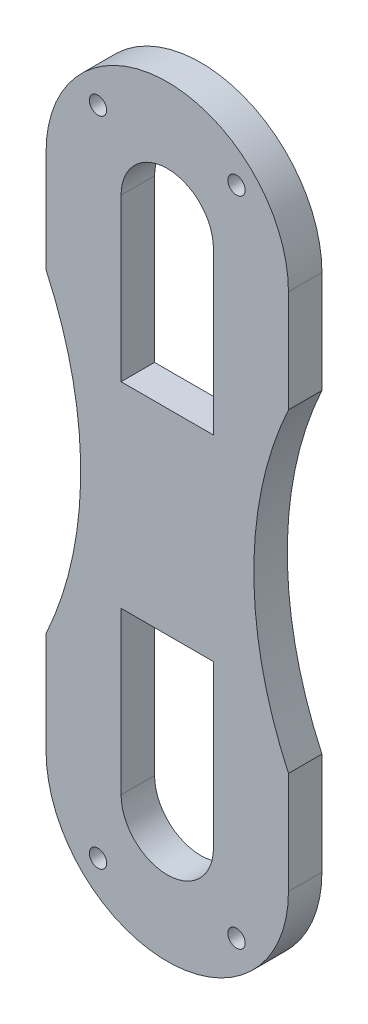
ISO-10303-21;
HEADER;
FILE_DESCRIPTION(('STEP AP214'),'2;1');
FILE_NAME('part.step','',(''),(''),'','','');
FILE_SCHEMA(('AUTOMOTIVE_DESIGN { 1 0 10303 214 1 1 1 1 }'));
ENDSEC;
DATA;
#1=APPLICATION_CONTEXT('core data for automotive mechanical design processes');
#2=APPLICATION_PROTOCOL_DEFINITION('international standard','automotive_design',2000,#1);
#3=PRODUCT_CONTEXT('',#1,'mechanical');
#4=PRODUCT('Part','Part','',(#3));
#5=PRODUCT_RELATED_PRODUCT_CATEGORY('part','',(#4));
#6=PRODUCT_DEFINITION_FORMATION('','',#4);
#7=PRODUCT_DEFINITION_CONTEXT('part definition',#1,'design');
#8=PRODUCT_DEFINITION('design','',#6,#7);
#9=PRODUCT_DEFINITION_SHAPE('','',#8);
#10=(LENGTH_UNIT() NAMED_UNIT(*) SI_UNIT(.MILLI.,.METRE.));
#11=(NAMED_UNIT(*) PLANE_ANGLE_UNIT() SI_UNIT($,.RADIAN.));
#12=(NAMED_UNIT(*) SI_UNIT($,.STERADIAN.) SOLID_ANGLE_UNIT());
#13=UNCERTAINTY_MEASURE_WITH_UNIT(LENGTH_MEASURE(1.E-05),#10,'distance_accuracy_value','');
#14=(GEOMETRIC_REPRESENTATION_CONTEXT(3) GLOBAL_UNCERTAINTY_ASSIGNED_CONTEXT((#13)) GLOBAL_UNIT_ASSIGNED_CONTEXT((#10,
#11,#12)) REPRESENTATION_CONTEXT('',''));
#15=CARTESIAN_POINT('',(0.,0.,0.));
#16=DIRECTION('',(0.,0.,1.));
#17=DIRECTION('',(1.,0.,0.));
#18=AXIS2_PLACEMENT_3D('',#15,#16,#17);
#19=CARTESIAN_POINT('',(4.,0.,2.9));
#20=DIRECTION('',(-1.,0.,0.));
#21=DIRECTION('',(0.,-1.,0.));
#22=AXIS2_PLACEMENT_3D('',#19,#20,#21);
#23=PLANE('',#22);
#24=DIRECTION('',(0.,1.,0.));
#25=VECTOR('',#24,1.);
#26=CARTESIAN_POINT('',(4.,0.,0.));
#27=LINE('',#26,#25);
#28=CARTESIAN_POINT('',(3.99999999999999,-22.5000003712386,0.));
#29=VERTEX_POINT('',#28);
#30=CARTESIAN_POINT('',(4.,-8.50000000000002,0.));
#31=VERTEX_POINT('',#30);
#32=EDGE_CURVE('E260',#29,#31,#27,.T.);
#33=ORIENTED_EDGE('',*,*,#32,.F.);
#34=DIRECTION('',(0.,0.,-1.));
#35=VECTOR('',#34,1.);
#36=CARTESIAN_POINT('',(3.99999999999999,-22.5000003712386,2.9));
#37=LINE('',#36,#35);
#38=CARTESIAN_POINT('',(3.99999999999999,-22.5000003712386,2.9));
#39=VERTEX_POINT('',#38);
#40=EDGE_CURVE('E11',#39,#29,#37,.T.);
#41=ORIENTED_EDGE('',*,*,#40,.F.);
#42=DIRECTION('',(0.,1.,0.));
#43=VECTOR('',#42,1.);
#44=CARTESIAN_POINT('',(4.,0.,2.9));
#45=LINE('',#44,#43);
#46=CARTESIAN_POINT('',(4.,-8.50000000000002,2.9));
#47=VERTEX_POINT('',#46);
#48=EDGE_CURVE('E172',#39,#47,#45,.T.);
#49=ORIENTED_EDGE('',*,*,#48,.T.);
#50=DIRECTION('',(0.,0.,-1.));
#51=VECTOR('',#50,1.);
#52=CARTESIAN_POINT('',(4.,-8.50000000000002,2.9));
#53=LINE('',#52,#51);
#54=EDGE_CURVE('E113',#47,#31,#53,.T.);
#55=ORIENTED_EDGE('',*,*,#54,.T.);
#56=EDGE_LOOP('',(#33,#41,#49,#55));
#57=FACE_BOUND('',#56,.T.);
#58=ADVANCED_FACE('F36',(#57),#23,.T.);
#59=CARTESIAN_POINT('',(0.,-22.5,2.9));
#60=DIRECTION('',(0.,0.,-1.));
#61=DIRECTION('',(-1.,0.,0.));
#62=AXIS2_PLACEMENT_3D('',#59,#60,#61);
#63=CYLINDRICAL_SURFACE('',#62,4.00000000000002);
#64=CARTESIAN_POINT('',(0.,-22.5,0.));
#65=DIRECTION('',(0.,0.,1.));
#66=DIRECTION('',(1.,0.,0.));
#67=AXIS2_PLACEMENT_3D('',#64,#65,#66);
#68=CIRCLE('',#67,4.00000000000002);
#69=CARTESIAN_POINT('',(-4.00000000000001,-22.4999996286907,0.));
#70=VERTEX_POINT('',#69);
#71=EDGE_CURVE('E177',#29,#70,#68,.F.);
#72=ORIENTED_EDGE('',*,*,#71,.T.);
#73=DIRECTION('',(0.,0.,-1.));
#74=VECTOR('',#73,1.);
#75=CARTESIAN_POINT('',(-4.00000000000001,-22.4999996286907,2.9));
#76=LINE('',#75,#74);
#77=CARTESIAN_POINT('',(-4.00000000000001,-22.4999996286907,2.9));
#78=VERTEX_POINT('',#77);
#79=EDGE_CURVE('E46',#78,#70,#76,.T.);
#80=ORIENTED_EDGE('',*,*,#79,.F.);
#81=CARTESIAN_POINT('',(0.,-22.5,2.9));
#82=DIRECTION('',(0.,0.,1.));
#83=DIRECTION('',(1.,0.,0.));
#84=AXIS2_PLACEMENT_3D('',#81,#82,#83);
#85=CIRCLE('',#84,4.00000000000002);
#86=EDGE_CURVE('E167',#39,#78,#85,.F.);
#87=ORIENTED_EDGE('',*,*,#86,.F.);
#88=ORIENTED_EDGE('',*,*,#40,.T.);
#89=EDGE_LOOP('',(#72,#80,#87,#88));
#90=FACE_BOUND('',#89,.T.);
#91=ADVANCED_FACE('F175',(#90),#63,.F.);
#92=CARTESIAN_POINT('',(-4.00000000000001,0.,2.9));
#93=DIRECTION('',(-1.,0.,0.));
#94=DIRECTION('',(0.,-1.,0.));
#95=AXIS2_PLACEMENT_3D('',#92,#93,#94);
#96=PLANE('',#95);
#97=DIRECTION('',(0.,1.,0.));
#98=VECTOR('',#97,1.);
#99=CARTESIAN_POINT('',(-4.00000000000001,0.,0.));
#100=LINE('',#99,#98);
#101=CARTESIAN_POINT('',(-4.00000000000001,-8.50000000000002,0.));
#102=VERTEX_POINT('',#101);
#103=EDGE_CURVE('E263',#70,#102,#100,.T.);
#104=ORIENTED_EDGE('',*,*,#103,.T.);
#105=DIRECTION('',(0.,0.,-1.));
#106=VECTOR('',#105,1.);
#107=CARTESIAN_POINT('',(-4.00000000000001,-8.50000000000002,2.9));
#108=LINE('',#107,#106);
#109=CARTESIAN_POINT('',(-4.00000000000001,-8.50000000000002,2.9));
#110=VERTEX_POINT('',#109);
#111=EDGE_CURVE('E166',#110,#102,#108,.T.);
#112=ORIENTED_EDGE('',*,*,#111,.F.);
#113=DIRECTION('',(0.,1.,0.));
#114=VECTOR('',#113,1.);
#115=CARTESIAN_POINT('',(-4.00000000000001,0.,2.9));
#116=LINE('',#115,#114);
#117=EDGE_CURVE('E160',#78,#110,#116,.T.);
#118=ORIENTED_EDGE('',*,*,#117,.F.);
#119=ORIENTED_EDGE('',*,*,#79,.T.);
#120=EDGE_LOOP('',(#104,#112,#118,#119));
#121=FACE_BOUND('',#120,.T.);
#122=ADVANCED_FACE('F163',(#121),#96,.F.);
#123=CARTESIAN_POINT('',(-10.5,0.,2.9));
#124=DIRECTION('',(1.,0.,0.));
#125=DIRECTION('',(0.,1.,0.));
#126=AXIS2_PLACEMENT_3D('',#123,#124,#125);
#127=PLANE('',#126);
#128=DIRECTION('',(0.,-1.,0.));
#129=VECTOR('',#128,1.);
#130=CARTESIAN_POINT('',(-10.5,0.,0.));
#131=LINE('',#130,#129);
#132=CARTESIAN_POINT('',(-10.5,22.5,0.));
#133=VERTEX_POINT('',#132);
#134=CARTESIAN_POINT('',(-10.5,13.6381816969859,0.));
#135=VERTEX_POINT('',#134);
#136=EDGE_CURVE('E238',#133,#135,#131,.T.);
#137=ORIENTED_EDGE('',*,*,#136,.T.);
#138=DIRECTION('',(0.,0.,-1.));
#139=VECTOR('',#138,1.);
#140=CARTESIAN_POINT('',(-10.5,13.6381816969859,2.9));
#141=LINE('',#140,#139);
#142=CARTESIAN_POINT('',(-10.5,13.6381816969859,2.9));
#143=VERTEX_POINT('',#142);
#144=EDGE_CURVE('E198',#143,#135,#141,.T.);
#145=ORIENTED_EDGE('',*,*,#144,.F.);
#146=DIRECTION('',(0.,-1.,0.));
#147=VECTOR('',#146,1.);
#148=CARTESIAN_POINT('',(-10.5,0.,2.9));
#149=LINE('',#148,#147);
#150=CARTESIAN_POINT('',(-10.5,22.5,2.9));
#151=VERTEX_POINT('',#150);
#152=EDGE_CURVE('E290',#151,#143,#149,.T.);
#153=ORIENTED_EDGE('',*,*,#152,.F.);
#154=DIRECTION('',(0.,0.,-1.));
#155=VECTOR('',#154,1.);
#156=CARTESIAN_POINT('',(-10.5,22.5,2.9));
#157=LINE('',#156,#155);
#158=EDGE_CURVE('E182',#151,#133,#157,.T.);
#159=ORIENTED_EDGE('',*,*,#158,.T.);
#160=EDGE_LOOP('',(#137,#145,#153,#159));
#161=FACE_BOUND('',#160,.T.);
#162=ADVANCED_FACE('F375',(#161),#127,.F.);
#163=CARTESIAN_POINT('',(-40.,0.,2.9));
#164=DIRECTION('',(0.,0.,-1.));
#165=DIRECTION('',(-1.,0.,0.));
#166=AXIS2_PLACEMENT_3D('',#163,#164,#165);
#167=CYLINDRICAL_SURFACE('',#166,32.5);
#168=CARTESIAN_POINT('',(-40.,0.,0.));
#169=DIRECTION('',(0.,0.,1.));
#170=DIRECTION('',(1.,0.,0.));
#171=AXIS2_PLACEMENT_3D('',#168,#169,#170);
#172=CIRCLE('',#171,32.5);
#173=CARTESIAN_POINT('',(-10.5,-13.6381816969859,0.));
#174=VERTEX_POINT('',#173);
#175=EDGE_CURVE('E241',#135,#174,#172,.F.);
#176=ORIENTED_EDGE('',*,*,#175,.T.);
#177=DIRECTION('',(0.,0.,-1.));
#178=VECTOR('',#177,1.);
#179=CARTESIAN_POINT('',(-10.5,-13.6381816969859,2.9));
#180=LINE('',#179,#178);
#181=CARTESIAN_POINT('',(-10.5,-13.6381816969859,2.9));
#182=VERTEX_POINT('',#181);
#183=EDGE_CURVE('E195',#182,#174,#180,.T.);
#184=ORIENTED_EDGE('',*,*,#183,.F.);
#185=CARTESIAN_POINT('',(-40.,0.,2.9));
#186=DIRECTION('',(0.,0.,1.));
#187=DIRECTION('',(1.,0.,0.));
#188=AXIS2_PLACEMENT_3D('',#185,#186,#187);
#189=CIRCLE('',#188,32.5);
#190=EDGE_CURVE('E293',#143,#182,#189,.F.);
#191=ORIENTED_EDGE('',*,*,#190,.F.);
#192=ORIENTED_EDGE('',*,*,#144,.T.);
#193=EDGE_LOOP('',(#176,#184,#191,#192));
#194=FACE_BOUND('',#193,.T.);
#195=ADVANCED_FACE('F371',(#194),#167,.F.);
#196=CARTESIAN_POINT('',(-10.5,0.,2.9));
#197=DIRECTION('',(1.,0.,0.));
#198=DIRECTION('',(0.,1.,0.));
#199=AXIS2_PLACEMENT_3D('',#196,#197,#198);
#200=PLANE('',#199);
#201=DIRECTION('',(0.,-1.,0.));
#202=VECTOR('',#201,1.);
#203=CARTESIAN_POINT('',(-10.5,0.,0.));
#204=LINE('',#203,#202);
#205=CARTESIAN_POINT('',(-10.5,-22.5,0.));
#206=VERTEX_POINT('',#205);
#207=EDGE_CURVE('E243',#174,#206,#204,.T.);
#208=ORIENTED_EDGE('',*,*,#207,.T.);
#209=DIRECTION('',(0.,0.,-1.));
#210=VECTOR('',#209,1.);
#211=CARTESIAN_POINT('',(-10.5,-22.5,2.9));
#212=LINE('',#211,#210);
#213=CARTESIAN_POINT('',(-10.5,-22.5,2.9));
#214=VERTEX_POINT('',#213);
#215=EDGE_CURVE('E193',#214,#206,#212,.T.);
#216=ORIENTED_EDGE('',*,*,#215,.F.);
#217=DIRECTION('',(0.,-1.,0.));
#218=VECTOR('',#217,1.);
#219=CARTESIAN_POINT('',(-10.5,0.,2.9));
#220=LINE('',#219,#218);
#221=EDGE_CURVE('E295',#182,#214,#220,.T.);
#222=ORIENTED_EDGE('',*,*,#221,.F.);
#223=ORIENTED_EDGE('',*,*,#183,.T.);
#224=EDGE_LOOP('',(#208,#216,#222,#223));
#225=FACE_BOUND('',#224,.T.);
#226=ADVANCED_FACE('F367',(#225),#200,.F.);
#227=CARTESIAN_POINT('',(0.,-22.5,2.9));
#228=DIRECTION('',(0.,0.,-1.));
#229=DIRECTION('',(-1.,0.,0.));
#230=AXIS2_PLACEMENT_3D('',#227,#228,#229);
#231=CYLINDRICAL_SURFACE('',#230,10.5);
#232=CARTESIAN_POINT('',(0.,-22.5,0.));
#233=DIRECTION('',(0.,0.,1.));
#234=DIRECTION('',(1.,0.,0.));
#235=AXIS2_PLACEMENT_3D('',#232,#233,#234);
#236=CIRCLE('',#235,10.5);
#237=CARTESIAN_POINT('',(10.5,-22.5,0.));
#238=VERTEX_POINT('',#237);
#239=EDGE_CURVE('E246',#238,#206,#236,.F.);
#240=ORIENTED_EDGE('',*,*,#239,.F.);
#241=DIRECTION('',(0.,0.,-1.));
#242=VECTOR('',#241,1.);
#243=CARTESIAN_POINT('',(10.5,-22.5,2.9));
#244=LINE('',#243,#242);
#245=CARTESIAN_POINT('',(10.5,-22.5,2.9));
#246=VERTEX_POINT('',#245);
#247=EDGE_CURVE('E191',#246,#238,#244,.T.);
#248=ORIENTED_EDGE('',*,*,#247,.F.);
#249=CARTESIAN_POINT('',(0.,-22.5,2.9));
#250=DIRECTION('',(0.,0.,1.));
#251=DIRECTION('',(1.,0.,0.));
#252=AXIS2_PLACEMENT_3D('',#249,#250,#251);
#253=CIRCLE('',#252,10.5);
#254=EDGE_CURVE('E297',#246,#214,#253,.F.);
#255=ORIENTED_EDGE('',*,*,#254,.T.);
#256=ORIENTED_EDGE('',*,*,#215,.T.);
#257=EDGE_LOOP('',(#240,#248,#255,#256));
#258=FACE_BOUND('',#257,.T.);
#259=ADVANCED_FACE('F363',(#258),#231,.T.);
#260=CARTESIAN_POINT('',(10.5,0.,2.9));
#261=DIRECTION('',(1.,0.,0.));
#262=DIRECTION('',(0.,1.,0.));
#263=AXIS2_PLACEMENT_3D('',#260,#261,#262);
#264=PLANE('',#263);
#265=DIRECTION('',(0.,-1.,0.));
#266=VECTOR('',#265,1.);
#267=CARTESIAN_POINT('',(10.5,0.,0.));
#268=LINE('',#267,#266);
#269=CARTESIAN_POINT('',(10.5,-13.6381816969859,0.));
#270=VERTEX_POINT('',#269);
#271=EDGE_CURVE('E249',#270,#238,#268,.T.);
#272=ORIENTED_EDGE('',*,*,#271,.F.);
#273=DIRECTION('',(0.,0.,-1.));
#274=VECTOR('',#273,1.);
#275=CARTESIAN_POINT('',(10.5,-13.6381816969859,2.9));
#276=LINE('',#275,#274);
#277=CARTESIAN_POINT('',(10.5,-13.6381816969859,2.9));
#278=VERTEX_POINT('',#277);
#279=EDGE_CURVE('E189',#278,#270,#276,.T.);
#280=ORIENTED_EDGE('',*,*,#279,.F.);
#281=DIRECTION('',(0.,-1.,0.));
#282=VECTOR('',#281,1.);
#283=CARTESIAN_POINT('',(10.5,0.,2.9));
#284=LINE('',#283,#282);
#285=EDGE_CURVE('E300',#278,#246,#284,.T.);
#286=ORIENTED_EDGE('',*,*,#285,.T.);
#287=ORIENTED_EDGE('',*,*,#247,.T.);
#288=EDGE_LOOP('',(#272,#280,#286,#287));
#289=FACE_BOUND('',#288,.T.);
#290=ADVANCED_FACE('F359',(#289),#264,.T.);
#291=CARTESIAN_POINT('',(40.,0.,2.9));
#292=DIRECTION('',(0.,0.,-1.));
#293=DIRECTION('',(-1.,0.,0.));
#294=AXIS2_PLACEMENT_3D('',#291,#292,#293);
#295=CYLINDRICAL_SURFACE('',#294,32.5);
#296=CARTESIAN_POINT('',(40.,0.,0.));
#297=DIRECTION('',(0.,0.,1.));
#298=DIRECTION('',(1.,0.,0.));
#299=AXIS2_PLACEMENT_3D('',#296,#297,#298);
#300=CIRCLE('',#299,32.5);
#301=CARTESIAN_POINT('',(10.5,13.6381816969859,0.));
#302=VERTEX_POINT('',#301);
#303=EDGE_CURVE('E252',#302,#270,#300,.T.);
#304=ORIENTED_EDGE('',*,*,#303,.F.);
#305=DIRECTION('',(0.,0.,-1.));
#306=VECTOR('',#305,1.);
#307=CARTESIAN_POINT('',(10.5,13.6381816969859,2.9));
#308=LINE('',#307,#306);
#309=CARTESIAN_POINT('',(10.5,13.6381816969859,2.9));
#310=VERTEX_POINT('',#309);
#311=EDGE_CURVE('E187',#310,#302,#308,.T.);
#312=ORIENTED_EDGE('',*,*,#311,.F.);
#313=CARTESIAN_POINT('',(40.,0.,2.9));
#314=DIRECTION('',(0.,0.,1.));
#315=DIRECTION('',(1.,0.,0.));
#316=AXIS2_PLACEMENT_3D('',#313,#314,#315);
#317=CIRCLE('',#316,32.5);
#318=EDGE_CURVE('E303',#310,#278,#317,.T.);
#319=ORIENTED_EDGE('',*,*,#318,.T.);
#320=ORIENTED_EDGE('',*,*,#279,.T.);
#321=EDGE_LOOP('',(#304,#312,#319,#320));
#322=FACE_BOUND('',#321,.T.);
#323=ADVANCED_FACE('F355',(#322),#295,.F.);
#324=CARTESIAN_POINT('',(10.5,0.,2.9));
#325=DIRECTION('',(1.,0.,0.));
#326=DIRECTION('',(0.,1.,0.));
#327=AXIS2_PLACEMENT_3D('',#324,#325,#326);
#328=PLANE('',#327);
#329=DIRECTION('',(0.,-1.,0.));
#330=VECTOR('',#329,1.);
#331=CARTESIAN_POINT('',(10.5,0.,0.));
#332=LINE('',#331,#330);
#333=CARTESIAN_POINT('',(10.5,22.5,0.));
#334=VERTEX_POINT('',#333);
#335=EDGE_CURVE('E255',#334,#302,#332,.T.);
#336=ORIENTED_EDGE('',*,*,#335,.F.);
#337=DIRECTION('',(0.,0.,-1.));
#338=VECTOR('',#337,1.);
#339=CARTESIAN_POINT('',(10.5,22.5,2.9));
#340=LINE('',#339,#338);
#341=CARTESIAN_POINT('',(10.5,22.5,2.9));
#342=VERTEX_POINT('',#341);
#343=EDGE_CURVE('E185',#342,#334,#340,.T.);
#344=ORIENTED_EDGE('',*,*,#343,.F.);
#345=DIRECTION('',(0.,-1.,0.));
#346=VECTOR('',#345,1.);
#347=CARTESIAN_POINT('',(10.5,0.,2.9));
#348=LINE('',#347,#346);
#349=EDGE_CURVE('E306',#342,#310,#348,.T.);
#350=ORIENTED_EDGE('',*,*,#349,.T.);
#351=ORIENTED_EDGE('',*,*,#311,.T.);
#352=EDGE_LOOP('',(#336,#344,#350,#351));
#353=FACE_BOUND('',#352,.T.);
#354=ADVANCED_FACE('F352',(#353),#328,.T.);
#355=CARTESIAN_POINT('',(0.,22.5,2.9));
#356=DIRECTION('',(0.,0.,-1.));
#357=DIRECTION('',(-1.,0.,0.));
#358=AXIS2_PLACEMENT_3D('',#355,#356,#357);
#359=CYLINDRICAL_SURFACE('',#358,4.00000000000002);
#360=CARTESIAN_POINT('',(0.,22.5,0.));
#361=DIRECTION('',(0.,0.,1.));
#362=DIRECTION('',(1.,0.,0.));
#363=AXIS2_PLACEMENT_3D('',#360,#361,#362);
#364=CIRCLE('',#363,4.00000000000002);
#365=CARTESIAN_POINT('',(3.99999999999999,22.5000003712386,0.));
#366=VERTEX_POINT('',#365);
#367=CARTESIAN_POINT('',(-4.00000000000001,22.4999996286907,0.));
#368=VERTEX_POINT('',#367);
#369=EDGE_CURVE('E223',#366,#368,#364,.T.);
#370=ORIENTED_EDGE('',*,*,#369,.F.);
#371=DIRECTION('',(0.,0.,-1.));
#372=VECTOR('',#371,1.);
#373=CARTESIAN_POINT('',(3.99999999999999,22.5000003712386,2.9));
#374=LINE('',#373,#372);
#375=CARTESIAN_POINT('',(3.99999999999999,22.5000003712386,2.9));
#376=VERTEX_POINT('',#375);
#377=EDGE_CURVE('E40',#376,#366,#374,.T.);
#378=ORIENTED_EDGE('',*,*,#377,.F.);
#379=CARTESIAN_POINT('',(0.,22.5,2.9));
#380=DIRECTION('',(0.,0.,1.));
#381=DIRECTION('',(1.,0.,0.));
#382=AXIS2_PLACEMENT_3D('',#379,#380,#381);
#383=CIRCLE('',#382,4.00000000000002);
#384=CARTESIAN_POINT('',(-4.00000000000001,22.4999996286907,2.9));
#385=VERTEX_POINT('',#384);
#386=EDGE_CURVE('E280',#376,#385,#383,.T.);
#387=ORIENTED_EDGE('',*,*,#386,.T.);
#388=DIRECTION('',(0.,0.,-1.));
#389=VECTOR('',#388,1.);
#390=CARTESIAN_POINT('',(-4.00000000000001,22.4999996286907,2.9));
#391=LINE('',#390,#389);
#392=EDGE_CURVE('E201',#385,#368,#391,.T.);
#393=ORIENTED_EDGE('',*,*,#392,.T.);
#394=EDGE_LOOP('',(#370,#378,#387,#393));
#395=FACE_BOUND('',#394,.T.);
#396=ADVANCED_FACE('F227',(#395),#359,.F.);
#397=CARTESIAN_POINT('',(4.,0.,2.9));
#398=DIRECTION('',(1.,0.,0.));
#399=DIRECTION('',(0.,1.,0.));
#400=AXIS2_PLACEMENT_3D('',#397,#398,#399);
#401=PLANE('',#400);
#402=DIRECTION('',(0.,-1.,0.));
#403=VECTOR('',#402,1.);
#404=CARTESIAN_POINT('',(4.,0.,0.));
#405=LINE('',#404,#403);
#406=CARTESIAN_POINT('',(4.,8.50000000000002,0.));
#407=VERTEX_POINT('',#406);
#408=EDGE_CURVE('E214',#366,#407,#405,.T.);
#409=ORIENTED_EDGE('',*,*,#408,.T.);
#410=DIRECTION('',(0.,0.,-1.));
#411=VECTOR('',#410,1.);
#412=CARTESIAN_POINT('',(4.,8.50000000000002,2.9));
#413=LINE('',#412,#411);
#414=CARTESIAN_POINT('',(4.,8.50000000000002,2.9));
#415=VERTEX_POINT('',#414);
#416=EDGE_CURVE('E205',#415,#407,#413,.T.);
#417=ORIENTED_EDGE('',*,*,#416,.F.);
#418=DIRECTION('',(0.,-1.,0.));
#419=VECTOR('',#418,1.);
#420=CARTESIAN_POINT('',(4.,0.,2.9));
#421=LINE('',#420,#419);
#422=EDGE_CURVE('E216',#376,#415,#421,.T.);
#423=ORIENTED_EDGE('',*,*,#422,.F.);
#424=ORIENTED_EDGE('',*,*,#377,.T.);
#425=EDGE_LOOP('',(#409,#417,#423,#424));
#426=FACE_BOUND('',#425,.T.);
#427=ADVANCED_FACE('F213',(#426),#401,.F.);
#428=CARTESIAN_POINT('',(0.,8.50000000000002,2.9));
#429=DIRECTION('',(0.,1.,0.));
#430=DIRECTION('',(-1.,0.,0.));
#431=AXIS2_PLACEMENT_3D('',#428,#429,#430);
#432=PLANE('',#431);
#433=DIRECTION('',(1.,0.,0.));
#434=VECTOR('',#433,1.);
#435=CARTESIAN_POINT('',(0.,8.50000000000002,0.));
#436=LINE('',#435,#434);
#437=CARTESIAN_POINT('',(-4.00000000000001,8.50000000000002,0.));
#438=VERTEX_POINT('',#437);
#439=EDGE_CURVE('E225',#438,#407,#436,.T.);
#440=ORIENTED_EDGE('',*,*,#439,.F.);
#441=DIRECTION('',(0.,0.,-1.));
#442=VECTOR('',#441,1.);
#443=CARTESIAN_POINT('',(-4.00000000000001,8.50000000000002,2.9));
#444=LINE('',#443,#442);
#445=CARTESIAN_POINT('',(-4.00000000000001,8.50000000000002,2.9));
#446=VERTEX_POINT('',#445);
#447=EDGE_CURVE('E203',#446,#438,#444,.T.);
#448=ORIENTED_EDGE('',*,*,#447,.F.);
#449=DIRECTION('',(1.,0.,0.));
#450=VECTOR('',#449,1.);
#451=CARTESIAN_POINT('',(0.,8.50000000000002,2.9));
#452=LINE('',#451,#450);
#453=EDGE_CURVE('E285',#446,#415,#452,.T.);
#454=ORIENTED_EDGE('',*,*,#453,.T.);
#455=ORIENTED_EDGE('',*,*,#416,.T.);
#456=EDGE_LOOP('',(#440,#448,#454,#455));
#457=FACE_BOUND('',#456,.T.);
#458=ADVANCED_FACE('F380',(#457),#432,.T.);
#459=CARTESIAN_POINT('',(6.,-28.25,2.9));
#460=DIRECTION('',(0.,0.,-1.));
#461=DIRECTION('',(-1.,0.,0.));
#462=AXIS2_PLACEMENT_3D('',#459,#460,#461);
#463=CYLINDRICAL_SURFACE('',#462,0.75);
#464=CARTESIAN_POINT('',(6.,-28.25,2.9));
#465=DIRECTION('',(0.,0.,1.));
#466=DIRECTION('',(1.,0.,0.));
#467=AXIS2_PLACEMENT_3D('',#464,#465,#466);
#468=CIRCLE('',#467,0.75);
#469=CARTESIAN_POINT('',(6.75,-28.25,2.9));
#470=VERTEX_POINT('',#469);
#471=EDGE_CURVE('E313',#470,#470,#468,.T.);
#472=ORIENTED_EDGE('',*,*,#471,.T.);
#473=EDGE_LOOP('',(#472));
#474=FACE_BOUND('',#473,.T.);
#475=CARTESIAN_POINT('',(6.,-28.25,0.));
#476=DIRECTION('',(0.,0.,1.));
#477=DIRECTION('',(1.,0.,0.));
#478=AXIS2_PLACEMENT_3D('',#475,#476,#477);
#479=CIRCLE('',#478,0.75);
#480=CARTESIAN_POINT('',(6.75,-28.25,0.));
#481=VERTEX_POINT('',#480);
#482=EDGE_CURVE('E266',#481,#481,#479,.T.);
#483=ORIENTED_EDGE('',*,*,#482,.F.);
#484=EDGE_LOOP('',(#483));
#485=FACE_BOUND('',#484,.T.);
#486=ADVANCED_FACE('F383',(#474,#485),#463,.F.);
#487=CARTESIAN_POINT('',(0.,-8.50000000000002,2.9));
#488=DIRECTION('',(0.,1.,0.));
#489=DIRECTION('',(-1.,0.,0.));
#490=AXIS2_PLACEMENT_3D('',#487,#488,#489);
#491=PLANE('',#490);
#492=DIRECTION('',(1.,0.,0.));
#493=VECTOR('',#492,1.);
#494=CARTESIAN_POINT('',(0.,-8.50000000000002,0.));
#495=LINE('',#494,#493);
#496=EDGE_CURVE('E106',#102,#31,#495,.T.);
#497=ORIENTED_EDGE('',*,*,#496,.T.);
#498=ORIENTED_EDGE('',*,*,#54,.F.);
#499=DIRECTION('',(1.,0.,0.));
#500=VECTOR('',#499,1.);
#501=CARTESIAN_POINT('',(0.,-8.50000000000002,2.9));
#502=LINE('',#501,#500);
#503=EDGE_CURVE('E55',#110,#47,#502,.T.);
#504=ORIENTED_EDGE('',*,*,#503,.F.);
#505=ORIENTED_EDGE('',*,*,#111,.T.);
#506=EDGE_LOOP('',(#497,#498,#504,#505));
#507=FACE_BOUND('',#506,.T.);
#508=ADVANCED_FACE('F350',(#507),#491,.F.);
#509=CARTESIAN_POINT('',(0.,22.5,2.9));
#510=DIRECTION('',(0.,0.,-1.));
#511=DIRECTION('',(-1.,0.,0.));
#512=AXIS2_PLACEMENT_3D('',#509,#510,#511);
#513=CYLINDRICAL_SURFACE('',#512,10.5);
#514=CARTESIAN_POINT('',(0.,22.5,0.));
#515=DIRECTION('',(0.,0.,1.));
#516=DIRECTION('',(1.,0.,0.));
#517=AXIS2_PLACEMENT_3D('',#514,#515,#516);
#518=CIRCLE('',#517,10.5);
#519=EDGE_CURVE('E258',#334,#133,#518,.T.);
#520=ORIENTED_EDGE('',*,*,#519,.T.);
#521=ORIENTED_EDGE('',*,*,#158,.F.);
#522=CARTESIAN_POINT('',(0.,22.5,2.9));
#523=DIRECTION('',(0.,0.,1.));
#524=DIRECTION('',(1.,0.,0.));
#525=AXIS2_PLACEMENT_3D('',#522,#523,#524);
#526=CIRCLE('',#525,10.5);
#527=EDGE_CURVE('E309',#342,#151,#526,.T.);
#528=ORIENTED_EDGE('',*,*,#527,.F.);
#529=ORIENTED_EDGE('',*,*,#343,.T.);
#530=EDGE_LOOP('',(#520,#521,#528,#529));
#531=FACE_BOUND('',#530,.T.);
#532=ADVANCED_FACE('F336',(#531),#513,.T.);
#533=CARTESIAN_POINT('',(-4.00000000000001,0.,2.9));
#534=DIRECTION('',(1.,0.,0.));
#535=DIRECTION('',(0.,1.,0.));
#536=AXIS2_PLACEMENT_3D('',#533,#534,#535);
#537=PLANE('',#536);
#538=DIRECTION('',(0.,-1.,0.));
#539=VECTOR('',#538,1.);
#540=CARTESIAN_POINT('',(-4.00000000000001,0.,0.));
#541=LINE('',#540,#539);
#542=EDGE_CURVE('E236',#368,#438,#541,.T.);
#543=ORIENTED_EDGE('',*,*,#542,.F.);
#544=ORIENTED_EDGE('',*,*,#392,.F.);
#545=DIRECTION('',(0.,-1.,0.));
#546=VECTOR('',#545,1.);
#547=CARTESIAN_POINT('',(-4.00000000000001,0.,2.9));
#548=LINE('',#547,#546);
#549=EDGE_CURVE('E287',#385,#446,#548,.T.);
#550=ORIENTED_EDGE('',*,*,#549,.T.);
#551=ORIENTED_EDGE('',*,*,#447,.T.);
#552=EDGE_LOOP('',(#543,#544,#550,#551));
#553=FACE_BOUND('',#552,.T.);
#554=ADVANCED_FACE('F328',(#553),#537,.T.);
#555=CARTESIAN_POINT('',(-6.,28.25,2.9));
#556=DIRECTION('',(0.,0.,-1.));
#557=DIRECTION('',(-1.,0.,0.));
#558=AXIS2_PLACEMENT_3D('',#555,#556,#557);
#559=CYLINDRICAL_SURFACE('',#558,0.75);
#560=CARTESIAN_POINT('',(-6.,28.25,2.9));
#561=DIRECTION('',(0.,0.,1.));
#562=DIRECTION('',(1.,0.,0.));
#563=AXIS2_PLACEMENT_3D('',#560,#561,#562);
#564=CIRCLE('',#563,0.75);
#565=CARTESIAN_POINT('',(-5.25,28.25,2.9));
#566=VERTEX_POINT('',#565);
#567=EDGE_CURVE('E275',#566,#566,#564,.T.);
#568=ORIENTED_EDGE('',*,*,#567,.T.);
#569=EDGE_LOOP('',(#568));
#570=FACE_BOUND('',#569,.T.);
#571=CARTESIAN_POINT('',(-6.,28.25,0.));
#572=DIRECTION('',(0.,0.,1.));
#573=DIRECTION('',(1.,0.,0.));
#574=AXIS2_PLACEMENT_3D('',#571,#572,#573);
#575=CIRCLE('',#574,0.75);
#576=CARTESIAN_POINT('',(-5.25,28.25,0.));
#577=VERTEX_POINT('',#576);
#578=EDGE_CURVE('E228',#577,#577,#575,.T.);
#579=ORIENTED_EDGE('',*,*,#578,.F.);
#580=EDGE_LOOP('',(#579));
#581=FACE_BOUND('',#580,.T.);
#582=ADVANCED_FACE('F326',(#570,#581),#559,.F.);
#583=CARTESIAN_POINT('',(6.,28.25,2.9));
#584=DIRECTION('',(0.,0.,-1.));
#585=DIRECTION('',(-1.,0.,0.));
#586=AXIS2_PLACEMENT_3D('',#583,#584,#585);
#587=CYLINDRICAL_SURFACE('',#586,0.75);
#588=CARTESIAN_POINT('',(6.,28.25,2.9));
#589=DIRECTION('',(0.,0.,1.));
#590=DIRECTION('',(1.,0.,0.));
#591=AXIS2_PLACEMENT_3D('',#588,#589,#590);
#592=CIRCLE('',#591,0.75);
#593=CARTESIAN_POINT('',(6.75,28.25,2.9));
#594=VERTEX_POINT('',#593);
#595=EDGE_CURVE('E271',#594,#594,#592,.F.);
#596=ORIENTED_EDGE('',*,*,#595,.F.);
#597=EDGE_LOOP('',(#596));
#598=FACE_BOUND('',#597,.T.);
#599=CARTESIAN_POINT('',(6.,28.25,0.));
#600=DIRECTION('',(0.,0.,1.));
#601=DIRECTION('',(1.,0.,0.));
#602=AXIS2_PLACEMENT_3D('',#599,#600,#601);
#603=CIRCLE('',#602,0.75);
#604=CARTESIAN_POINT('',(6.75,28.25,0.));
#605=VERTEX_POINT('',#604);
#606=EDGE_CURVE('E231',#605,#605,#603,.F.);
#607=ORIENTED_EDGE('',*,*,#606,.T.);
#608=EDGE_LOOP('',(#607));
#609=FACE_BOUND('',#608,.T.);
#610=ADVANCED_FACE('F38',(#598,#609),#587,.F.);
#611=CARTESIAN_POINT('',(-6.,-28.25,2.9));
#612=DIRECTION('',(0.,0.,-1.));
#613=DIRECTION('',(-1.,0.,0.));
#614=AXIS2_PLACEMENT_3D('',#611,#612,#613);
#615=CYLINDRICAL_SURFACE('',#614,0.75);
#616=CARTESIAN_POINT('',(-6.,-28.25,2.9));
#617=DIRECTION('',(0.,0.,1.));
#618=DIRECTION('',(1.,0.,0.));
#619=AXIS2_PLACEMENT_3D('',#616,#617,#618);
#620=CIRCLE('',#619,0.75);
#621=CARTESIAN_POINT('',(-5.25,-28.25,2.9));
#622=VERTEX_POINT('',#621);
#623=EDGE_CURVE('E204',#622,#622,#620,.F.);
#624=ORIENTED_EDGE('',*,*,#623,.F.);
#625=EDGE_LOOP('',(#624));
#626=FACE_BOUND('',#625,.T.);
#627=CARTESIAN_POINT('',(-6.,-28.25,0.));
#628=DIRECTION('',(0.,0.,1.));
#629=DIRECTION('',(1.,0.,0.));
#630=AXIS2_PLACEMENT_3D('',#627,#628,#629);
#631=CIRCLE('',#630,0.75);
#632=CARTESIAN_POINT('',(-5.25,-28.25,0.));
#633=VERTEX_POINT('',#632);
#634=EDGE_CURVE('E269',#633,#633,#631,.F.);
#635=ORIENTED_EDGE('',*,*,#634,.T.);
#636=EDGE_LOOP('',(#635));
#637=FACE_BOUND('',#636,.T.);
#638=ADVANCED_FACE('F334',(#626,#637),#615,.F.);
#639=CARTESIAN_POINT('',(0.,0.,2.9));
#640=DIRECTION('',(0.,0.,1.));
#641=DIRECTION('',(1.,0.,0.));
#642=AXIS2_PLACEMENT_3D('',#639,#640,#641);
#643=PLANE('',#642);
#644=ORIENTED_EDGE('',*,*,#595,.T.);
#645=EDGE_LOOP('',(#644));
#646=FACE_BOUND('',#645,.T.);
#647=ORIENTED_EDGE('',*,*,#567,.F.);
#648=EDGE_LOOP('',(#647));
#649=FACE_BOUND('',#648,.T.);
#650=ORIENTED_EDGE('',*,*,#386,.F.);
#651=ORIENTED_EDGE('',*,*,#422,.T.);
#652=ORIENTED_EDGE('',*,*,#453,.F.);
#653=ORIENTED_EDGE('',*,*,#549,.F.);
#654=EDGE_LOOP('',(#650,#651,#652,#653));
#655=FACE_BOUND('',#654,.T.);
#656=ORIENTED_EDGE('',*,*,#152,.T.);
#657=ORIENTED_EDGE('',*,*,#190,.T.);
#658=ORIENTED_EDGE('',*,*,#221,.T.);
#659=ORIENTED_EDGE('',*,*,#254,.F.);
#660=ORIENTED_EDGE('',*,*,#285,.F.);
#661=ORIENTED_EDGE('',*,*,#318,.F.);
#662=ORIENTED_EDGE('',*,*,#349,.F.);
#663=ORIENTED_EDGE('',*,*,#527,.T.);
#664=EDGE_LOOP('',(#656,#657,#658,#659,#660,#661,#662,#663));
#665=FACE_BOUND('',#664,.T.);
#666=ORIENTED_EDGE('',*,*,#48,.F.);
#667=ORIENTED_EDGE('',*,*,#86,.T.);
#668=ORIENTED_EDGE('',*,*,#117,.T.);
#669=ORIENTED_EDGE('',*,*,#503,.T.);
#670=EDGE_LOOP('',(#666,#667,#668,#669));
#671=FACE_BOUND('',#670,.T.);
#672=ORIENTED_EDGE('',*,*,#471,.F.);
#673=EDGE_LOOP('',(#672));
#674=FACE_BOUND('',#673,.T.);
#675=ORIENTED_EDGE('',*,*,#623,.T.);
#676=EDGE_LOOP('',(#675));
#677=FACE_BOUND('',#676,.T.);
#678=ADVANCED_FACE('F170',(#646,#649,#655,#665,#671,#674,#677),#643,.T.);
#679=CARTESIAN_POINT('',(0.,0.,0.));
#680=DIRECTION('',(0.,0.,1.));
#681=DIRECTION('',(1.,0.,0.));
#682=AXIS2_PLACEMENT_3D('',#679,#680,#681);
#683=PLANE('',#682);
#684=ORIENTED_EDGE('',*,*,#606,.F.);
#685=EDGE_LOOP('',(#684));
#686=FACE_BOUND('',#685,.T.);
#687=ORIENTED_EDGE('',*,*,#578,.T.);
#688=EDGE_LOOP('',(#687));
#689=FACE_BOUND('',#688,.T.);
#690=ORIENTED_EDGE('',*,*,#369,.T.);
#691=ORIENTED_EDGE('',*,*,#542,.T.);
#692=ORIENTED_EDGE('',*,*,#439,.T.);
#693=ORIENTED_EDGE('',*,*,#408,.F.);
#694=EDGE_LOOP('',(#690,#691,#692,#693));
#695=FACE_BOUND('',#694,.T.);
#696=ORIENTED_EDGE('',*,*,#136,.F.);
#697=ORIENTED_EDGE('',*,*,#519,.F.);
#698=ORIENTED_EDGE('',*,*,#335,.T.);
#699=ORIENTED_EDGE('',*,*,#303,.T.);
#700=ORIENTED_EDGE('',*,*,#271,.T.);
#701=ORIENTED_EDGE('',*,*,#239,.T.);
#702=ORIENTED_EDGE('',*,*,#207,.F.);
#703=ORIENTED_EDGE('',*,*,#175,.F.);
#704=EDGE_LOOP('',(#696,#697,#698,#699,#700,#701,#702,#703));
#705=FACE_BOUND('',#704,.T.);
#706=ORIENTED_EDGE('',*,*,#32,.T.);
#707=ORIENTED_EDGE('',*,*,#496,.F.);
#708=ORIENTED_EDGE('',*,*,#103,.F.);
#709=ORIENTED_EDGE('',*,*,#71,.F.);
#710=EDGE_LOOP('',(#706,#707,#708,#709));
#711=FACE_BOUND('',#710,.T.);
#712=ORIENTED_EDGE('',*,*,#482,.T.);
#713=EDGE_LOOP('',(#712));
#714=FACE_BOUND('',#713,.T.);
#715=ORIENTED_EDGE('',*,*,#634,.F.);
#716=EDGE_LOOP('',(#715));
#717=FACE_BOUND('',#716,.T.);
#718=ADVANCED_FACE('F220',(#686,#689,#695,#705,#711,#714,#717),#683,.F.);
#719=CLOSED_SHELL('',(#58,#91,#122,#162,#195,#226,#259,#290,#323,#354,#396,#427,#458,#486,#508,
#532,#554,#582,#610,#638,#678,#718));
#720=MANIFOLD_SOLID_BREP('B2',#719);
#721=ADVANCED_BREP_SHAPE_REPRESENTATION('',(#18,#720),#14);
#722=SHAPE_DEFINITION_REPRESENTATION(#9,#721);
ENDSEC;
END-ISO-10303-21;
